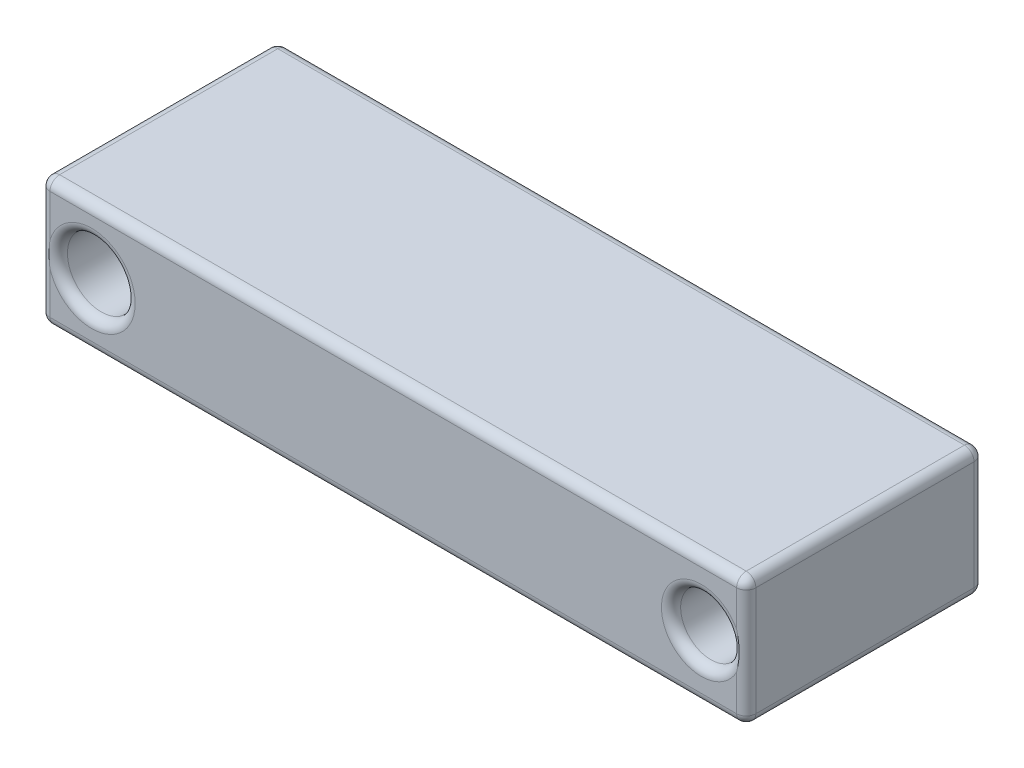
ISO-10303-21;
HEADER;
FILE_DESCRIPTION(('STEP AP214'),'2;1');
FILE_NAME('part.step','',(''),(''),'','','');
FILE_SCHEMA(('AUTOMOTIVE_DESIGN { 1 0 10303 214 1 1 1 1 }'));
ENDSEC;
DATA;
#1=APPLICATION_CONTEXT('core data for automotive mechanical design processes');
#2=APPLICATION_PROTOCOL_DEFINITION('international standard','automotive_design',2000,#1);
#3=PRODUCT_CONTEXT('',#1,'mechanical');
#4=PRODUCT('Part','Part','',(#3));
#5=PRODUCT_RELATED_PRODUCT_CATEGORY('part','',(#4));
#6=PRODUCT_DEFINITION_FORMATION('','',#4);
#7=PRODUCT_DEFINITION_CONTEXT('part definition',#1,'design');
#8=PRODUCT_DEFINITION('design','',#6,#7);
#9=PRODUCT_DEFINITION_SHAPE('','',#8);
#10=(LENGTH_UNIT() NAMED_UNIT(*) SI_UNIT(.MILLI.,.METRE.));
#11=(NAMED_UNIT(*) PLANE_ANGLE_UNIT() SI_UNIT($,.RADIAN.));
#12=(NAMED_UNIT(*) SI_UNIT($,.STERADIAN.) SOLID_ANGLE_UNIT());
#13=UNCERTAINTY_MEASURE_WITH_UNIT(LENGTH_MEASURE(1.E-05),#10,'distance_accuracy_value','');
#14=(GEOMETRIC_REPRESENTATION_CONTEXT(3) GLOBAL_UNCERTAINTY_ASSIGNED_CONTEXT((#13)) GLOBAL_UNIT_ASSIGNED_CONTEXT((#10,
#11,#12)) REPRESENTATION_CONTEXT('',''));
#15=CARTESIAN_POINT('',(0.,0.,0.));
#16=DIRECTION('',(0.,0.,1.));
#17=DIRECTION('',(1.,0.,0.));
#18=AXIS2_PLACEMENT_3D('',#15,#16,#17);
#19=CARTESIAN_POINT('',(-95.3818963448304,55.5062245954553,37.));
#20=DIRECTION('',(1.,0.,0.));
#21=DIRECTION('',(0.,1.,0.));
#22=AXIS2_PLACEMENT_3D('',#19,#20,#21);
#23=PLANE('',#22);
#24=DIRECTION('',(0.,-1.,0.));
#25=VECTOR('',#24,1.);
#26=CARTESIAN_POINT('',(-95.3818963448304,55.5062245954553,1.5));
#27=LINE('',#26,#25);
#28=CARTESIAN_POINT('',(-95.3818963448304,54.0062245954553,1.5));
#29=VERTEX_POINT('',#28);
#30=CARTESIAN_POINT('',(-95.3818963448304,37.0062245954553,1.5));
#31=VERTEX_POINT('',#30);
#32=EDGE_CURVE('E196',#29,#31,#27,.T.);
#33=ORIENTED_EDGE('',*,*,#32,.T.);
#34=DIRECTION('',(0.,0.,-1.));
#35=VECTOR('',#34,1.);
#36=CARTESIAN_POINT('',(-95.3818963448304,37.0062245954553,37.));
#37=LINE('',#36,#35);
#38=CARTESIAN_POINT('',(-95.3818963448304,37.0062245954553,35.5));
#39=VERTEX_POINT('',#38);
#40=EDGE_CURVE('E198',#31,#39,#37,.F.);
#41=ORIENTED_EDGE('',*,*,#40,.T.);
#42=DIRECTION('',(0.,-1.,0.));
#43=VECTOR('',#42,1.);
#44=CARTESIAN_POINT('',(-95.3818963448304,55.5062245954553,35.5));
#45=LINE('',#44,#43);
#46=CARTESIAN_POINT('',(-95.3818963448304,54.0062245954553,35.5));
#47=VERTEX_POINT('',#46);
#48=EDGE_CURVE('E192',#39,#47,#45,.F.);
#49=ORIENTED_EDGE('',*,*,#48,.T.);
#50=DIRECTION('',(0.,0.,-1.));
#51=VECTOR('',#50,1.);
#52=CARTESIAN_POINT('',(-95.3818963448304,54.0062245954553,37.));
#53=LINE('',#52,#51);
#54=EDGE_CURVE('E194',#47,#29,#53,.T.);
#55=ORIENTED_EDGE('',*,*,#54,.T.);
#56=EDGE_LOOP('',(#33,#41,#49,#55));
#57=FACE_BOUND('',#56,.T.);
#58=ADVANCED_FACE('F31',(#57),#23,.F.);
#59=CARTESIAN_POINT('',(-95.3818963448304,35.5062245954553,37.));
#60=DIRECTION('',(0.,1.,0.));
#61=DIRECTION('',(0.,0.,1.));
#62=AXIS2_PLACEMENT_3D('',#59,#60,#61);
#63=PLANE('',#62);
#64=DIRECTION('',(1.,0.,0.));
#65=VECTOR('',#64,1.);
#66=CARTESIAN_POINT('',(-95.3818963448304,35.5062245954553,35.5));
#67=LINE('',#66,#65);
#68=CARTESIAN_POINT('',(13.1181036551696,35.5062245954553,35.5));
#69=VERTEX_POINT('',#68);
#70=CARTESIAN_POINT('',(-93.8818963448304,35.5062245954553,35.5));
#71=VERTEX_POINT('',#70);
#72=EDGE_CURVE('E152',#69,#71,#67,.F.);
#73=ORIENTED_EDGE('',*,*,#72,.T.);
#74=DIRECTION('',(0.,0.,-1.));
#75=VECTOR('',#74,1.);
#76=CARTESIAN_POINT('',(-93.8818963448304,35.5062245954553,37.));
#77=LINE('',#76,#75);
#78=CARTESIAN_POINT('',(-93.8818963448304,35.5062245954553,1.5));
#79=VERTEX_POINT('',#78);
#80=EDGE_CURVE('E190',#71,#79,#77,.T.);
#81=ORIENTED_EDGE('',*,*,#80,.T.);
#82=DIRECTION('',(1.,0.,0.));
#83=VECTOR('',#82,1.);
#84=CARTESIAN_POINT('',(-95.3818963448304,35.5062245954553,1.5));
#85=LINE('',#84,#83);
#86=CARTESIAN_POINT('',(13.1181036551696,35.5062245954553,1.5));
#87=VERTEX_POINT('',#86);
#88=EDGE_CURVE('E155',#79,#87,#85,.T.);
#89=ORIENTED_EDGE('',*,*,#88,.T.);
#90=DIRECTION('',(0.,0.,-1.));
#91=VECTOR('',#90,1.);
#92=CARTESIAN_POINT('',(13.1181036551696,35.5062245954553,37.));
#93=LINE('',#92,#91);
#94=EDGE_CURVE('E147',#87,#69,#93,.F.);
#95=ORIENTED_EDGE('',*,*,#94,.T.);
#96=EDGE_LOOP('',(#73,#81,#89,#95));
#97=FACE_BOUND('',#96,.T.);
#98=ADVANCED_FACE('F149',(#97),#63,.F.);
#99=CARTESIAN_POINT('',(14.6181036551696,55.5062245954553,37.));
#100=DIRECTION('',(-1.,0.,0.));
#101=DIRECTION('',(0.,0.,1.));
#102=AXIS2_PLACEMENT_3D('',#99,#100,#101);
#103=PLANE('',#102);
#104=DIRECTION('',(0.,1.,0.));
#105=VECTOR('',#104,1.);
#106=CARTESIAN_POINT('',(14.6181036551696,35.5062245954553,35.5));
#107=LINE('',#106,#105);
#108=CARTESIAN_POINT('',(14.6181036551696,54.0062245954553,35.5));
#109=VERTEX_POINT('',#108);
#110=CARTESIAN_POINT('',(14.6181036551696,37.0062245954553,35.5));
#111=VERTEX_POINT('',#110);
#112=EDGE_CURVE('E232',#109,#111,#107,.F.);
#113=ORIENTED_EDGE('',*,*,#112,.T.);
#114=DIRECTION('',(0.,0.,-1.));
#115=VECTOR('',#114,1.);
#116=CARTESIAN_POINT('',(14.6181036551696,37.0062245954553,37.));
#117=LINE('',#116,#115);
#118=CARTESIAN_POINT('',(14.6181036551696,37.0062245954553,1.5));
#119=VERTEX_POINT('',#118);
#120=EDGE_CURVE('E166',#111,#119,#117,.T.);
#121=ORIENTED_EDGE('',*,*,#120,.T.);
#122=DIRECTION('',(0.,1.,0.));
#123=VECTOR('',#122,1.);
#124=CARTESIAN_POINT('',(14.6181036551696,55.5062245954553,1.5));
#125=LINE('',#124,#123);
#126=CARTESIAN_POINT('',(14.6181036551696,54.0062245954553,1.5));
#127=VERTEX_POINT('',#126);
#128=EDGE_CURVE('E236',#119,#127,#125,.T.);
#129=ORIENTED_EDGE('',*,*,#128,.T.);
#130=DIRECTION('',(0.,0.,-1.));
#131=VECTOR('',#130,1.);
#132=CARTESIAN_POINT('',(14.6181036551696,54.0062245954553,37.));
#133=LINE('',#132,#131);
#134=EDGE_CURVE('E234',#127,#109,#133,.F.);
#135=ORIENTED_EDGE('',*,*,#134,.T.);
#136=EDGE_LOOP('',(#113,#121,#129,#135));
#137=FACE_BOUND('',#136,.T.);
#138=ADVANCED_FACE('F428',(#137),#103,.F.);
#139=CARTESIAN_POINT('',(-95.3818963448304,55.5062245954553,37.));
#140=DIRECTION('',(0.,-1.,0.));
#141=DIRECTION('',(0.,0.,-1.));
#142=AXIS2_PLACEMENT_3D('',#139,#140,#141);
#143=PLANE('',#142);
#144=DIRECTION('',(0.,0.,-1.));
#145=VECTOR('',#144,1.);
#146=CARTESIAN_POINT('',(13.1181036551696,55.5062245954553,37.));
#147=LINE('',#146,#145);
#148=CARTESIAN_POINT('',(13.1181036551696,55.5062245954553,35.5));
#149=VERTEX_POINT('',#148);
#150=CARTESIAN_POINT('',(13.1181036551696,55.5062245954553,1.5));
#151=VERTEX_POINT('',#150);
#152=EDGE_CURVE('E243',#149,#151,#147,.T.);
#153=ORIENTED_EDGE('',*,*,#152,.T.);
#154=DIRECTION('',(-1.,0.,0.));
#155=VECTOR('',#154,1.);
#156=CARTESIAN_POINT('',(-95.3818963448304,55.5062245954553,1.5));
#157=LINE('',#156,#155);
#158=CARTESIAN_POINT('',(-93.8818963448304,55.5062245954553,1.5));
#159=VERTEX_POINT('',#158);
#160=EDGE_CURVE('E246',#151,#159,#157,.T.);
#161=ORIENTED_EDGE('',*,*,#160,.T.);
#162=DIRECTION('',(0.,0.,-1.));
#163=VECTOR('',#162,1.);
#164=CARTESIAN_POINT('',(-93.8818963448304,55.5062245954553,37.));
#165=LINE('',#164,#163);
#166=CARTESIAN_POINT('',(-93.8818963448304,55.5062245954553,35.5));
#167=VERTEX_POINT('',#166);
#168=EDGE_CURVE('E241',#159,#167,#165,.F.);
#169=ORIENTED_EDGE('',*,*,#168,.T.);
#170=DIRECTION('',(-1.,0.,0.));
#171=VECTOR('',#170,1.);
#172=CARTESIAN_POINT('',(14.6181036551696,55.5062245954553,35.5));
#173=LINE('',#172,#171);
#174=EDGE_CURVE('E239',#167,#149,#173,.F.);
#175=ORIENTED_EDGE('',*,*,#174,.T.);
#176=EDGE_LOOP('',(#153,#161,#169,#175));
#177=FACE_BOUND('',#176,.T.);
#178=ADVANCED_FACE('F656',(#177),#143,.F.);
#179=CARTESIAN_POINT('',(-95.3818963448304,35.5062245954553,37.));
#180=DIRECTION('',(0.,0.,1.));
#181=DIRECTION('',(1.,0.,0.));
#182=AXIS2_PLACEMENT_3D('',#179,#180,#181);
#183=PLANE('',#182);
#184=CARTESIAN_POINT('',(-87.3818963448304,45.5062245954553,37.));
#185=DIRECTION('',(0.,0.,1.));
#186=DIRECTION('',(1.,0.,0.));
#187=AXIS2_PLACEMENT_3D('',#184,#185,#186);
#188=CIRCLE('',#187,6.77503221367372);
#189=CARTESIAN_POINT('',(-93.8818963448304,47.4169996989975,37.));
#190=VERTEX_POINT('',#189);
#191=CARTESIAN_POINT('',(-80.6068641311566,45.5062245954553,37.));
#192=VERTEX_POINT('',#191);
#193=EDGE_CURVE('E51',#190,#192,#188,.F.);
#194=ORIENTED_EDGE('',*,*,#193,.T.);
#195=CARTESIAN_POINT('',(-87.3818963448304,45.5062245954553,37.));
#196=DIRECTION('',(0.,0.,1.));
#197=DIRECTION('',(1.,0.,0.));
#198=AXIS2_PLACEMENT_3D('',#195,#196,#197);
#199=CIRCLE('',#198,6.77503221367372);
#200=CARTESIAN_POINT('',(-93.8818963448304,43.5954494919131,37.));
#201=VERTEX_POINT('',#200);
#202=EDGE_CURVE('E11',#192,#201,#199,.F.);
#203=ORIENTED_EDGE('',*,*,#202,.T.);
#204=DIRECTION('',(0.,-1.,0.));
#205=VECTOR('',#204,1.);
#206=CARTESIAN_POINT('',(-93.8818963448304,35.5062245954553,37.));
#207=LINE('',#206,#205);
#208=CARTESIAN_POINT('',(-93.8818963448304,37.0062245954553,37.));
#209=VERTEX_POINT('',#208);
#210=EDGE_CURVE('E40',#201,#209,#207,.T.);
#211=ORIENTED_EDGE('',*,*,#210,.T.);
#212=DIRECTION('',(1.,0.,0.));
#213=VECTOR('',#212,1.);
#214=CARTESIAN_POINT('',(14.6181036551696,37.0062245954553,37.));
#215=LINE('',#214,#213);
#216=CARTESIAN_POINT('',(13.1181036551696,37.0062245954553,37.));
#217=VERTEX_POINT('',#216);
#218=EDGE_CURVE('E259',#209,#217,#215,.T.);
#219=ORIENTED_EDGE('',*,*,#218,.T.);
#220=DIRECTION('',(0.,1.,0.));
#221=VECTOR('',#220,1.);
#222=CARTESIAN_POINT('',(13.1181036551696,55.5062245954553,37.));
#223=LINE('',#222,#221);
#224=CARTESIAN_POINT('',(13.1181036551696,42.614107788662,37.));
#225=VERTEX_POINT('',#224);
#226=EDGE_CURVE('E252',#217,#225,#223,.T.);
#227=ORIENTED_EDGE('',*,*,#226,.T.);
#228=CARTESIAN_POINT('',(7.61810365516963,45.5062245954553,37.));
#229=DIRECTION('',(0.,0.,1.));
#230=DIRECTION('',(1.,0.,0.));
#231=AXIS2_PLACEMENT_3D('',#228,#229,#230);
#232=CIRCLE('',#231,6.21404374173019);
#233=CARTESIAN_POINT('',(13.1181036551696,48.3983414022486,37.));
#234=VERTEX_POINT('',#233);
#235=EDGE_CURVE('E248',#225,#234,#232,.F.);
#236=ORIENTED_EDGE('',*,*,#235,.T.);
#237=DIRECTION('',(0.,1.,0.));
#238=VECTOR('',#237,1.);
#239=CARTESIAN_POINT('',(13.1181036551696,55.5062245954553,37.));
#240=LINE('',#239,#238);
#241=CARTESIAN_POINT('',(13.1181036551696,54.0062245954553,37.));
#242=VERTEX_POINT('',#241);
#243=EDGE_CURVE('E250',#234,#242,#240,.T.);
#244=ORIENTED_EDGE('',*,*,#243,.T.);
#245=DIRECTION('',(-1.,0.,0.));
#246=VECTOR('',#245,1.);
#247=CARTESIAN_POINT('',(-95.3818963448304,54.0062245954553,37.));
#248=LINE('',#247,#246);
#249=CARTESIAN_POINT('',(-93.8818963448304,54.0062245954553,37.));
#250=VERTEX_POINT('',#249);
#251=EDGE_CURVE('E254',#242,#250,#248,.T.);
#252=ORIENTED_EDGE('',*,*,#251,.T.);
#253=DIRECTION('',(0.,-1.,0.));
#254=VECTOR('',#253,1.);
#255=CARTESIAN_POINT('',(-93.8818963448304,35.5062245954553,37.));
#256=LINE('',#255,#254);
#257=EDGE_CURVE('E257',#250,#190,#256,.T.);
#258=ORIENTED_EDGE('',*,*,#257,.T.);
#259=EDGE_LOOP('',(#194,#203,#211,#219,#227,#236,#244,#252,#258));
#260=FACE_BOUND('',#259,.T.);
#261=ADVANCED_FACE('F406',(#260),#183,.T.);
#262=CARTESIAN_POINT('',(-95.3818963448304,35.5062245954553,0.));
#263=DIRECTION('',(0.,0.,1.));
#264=DIRECTION('',(1.,0.,0.));
#265=AXIS2_PLACEMENT_3D('',#262,#263,#264);
#266=PLANE('',#265);
#267=DIRECTION('',(0.,1.,0.));
#268=VECTOR('',#267,1.);
#269=CARTESIAN_POINT('',(13.1181036551696,35.5062245954553,0.));
#270=LINE('',#269,#268);
#271=CARTESIAN_POINT('',(13.1181036551696,42.614107788662,0.));
#272=VERTEX_POINT('',#271);
#273=CARTESIAN_POINT('',(13.1181036551696,37.0062245954553,0.));
#274=VERTEX_POINT('',#273);
#275=EDGE_CURVE('E209',#272,#274,#270,.F.);
#276=ORIENTED_EDGE('',*,*,#275,.T.);
#277=DIRECTION('',(1.,0.,0.));
#278=VECTOR('',#277,1.);
#279=CARTESIAN_POINT('',(-95.3818963448304,37.0062245954553,0.));
#280=LINE('',#279,#278);
#281=CARTESIAN_POINT('',(-93.8818963448304,37.0062245954553,0.));
#282=VERTEX_POINT('',#281);
#283=EDGE_CURVE('E217',#274,#282,#280,.F.);
#284=ORIENTED_EDGE('',*,*,#283,.T.);
#285=DIRECTION('',(0.,-1.,0.));
#286=VECTOR('',#285,1.);
#287=CARTESIAN_POINT('',(-93.8818963448304,35.5062245954553,0.));
#288=LINE('',#287,#286);
#289=CARTESIAN_POINT('',(-93.8818963448304,43.5954494919131,0.));
#290=VERTEX_POINT('',#289);
#291=EDGE_CURVE('E215',#282,#290,#288,.F.);
#292=ORIENTED_EDGE('',*,*,#291,.T.);
#293=CARTESIAN_POINT('',(-87.3818963448304,45.5062245954553,0.));
#294=DIRECTION('',(0.,0.,1.));
#295=DIRECTION('',(1.,0.,0.));
#296=AXIS2_PLACEMENT_3D('',#293,#294,#295);
#297=CIRCLE('',#296,6.77503221367372);
#298=CARTESIAN_POINT('',(-80.6068641311566,45.5062245954553,0.));
#299=VERTEX_POINT('',#298);
#300=EDGE_CURVE('E213',#290,#299,#297,.T.);
#301=ORIENTED_EDGE('',*,*,#300,.T.);
#302=CARTESIAN_POINT('',(-87.3818963448304,45.5062245954553,0.));
#303=DIRECTION('',(0.,0.,1.));
#304=DIRECTION('',(1.,0.,0.));
#305=AXIS2_PLACEMENT_3D('',#302,#303,#304);
#306=CIRCLE('',#305,6.77503221367372);
#307=CARTESIAN_POINT('',(-93.8818963448304,47.4169996989975,0.));
#308=VERTEX_POINT('',#307);
#309=EDGE_CURVE('E211',#299,#308,#306,.T.);
#310=ORIENTED_EDGE('',*,*,#309,.T.);
#311=DIRECTION('',(0.,-1.,0.));
#312=VECTOR('',#311,1.);
#313=CARTESIAN_POINT('',(-93.8818963448304,35.5062245954553,0.));
#314=LINE('',#313,#312);
#315=CARTESIAN_POINT('',(-93.8818963448304,54.0062245954553,0.));
#316=VERTEX_POINT('',#315);
#317=EDGE_CURVE('E207',#308,#316,#314,.F.);
#318=ORIENTED_EDGE('',*,*,#317,.T.);
#319=DIRECTION('',(-1.,0.,0.));
#320=VECTOR('',#319,1.);
#321=CARTESIAN_POINT('',(-95.3818963448304,54.0062245954553,0.));
#322=LINE('',#321,#320);
#323=CARTESIAN_POINT('',(13.1181036551696,54.0062245954553,0.));
#324=VERTEX_POINT('',#323);
#325=EDGE_CURVE('E201',#316,#324,#322,.F.);
#326=ORIENTED_EDGE('',*,*,#325,.T.);
#327=DIRECTION('',(0.,1.,0.));
#328=VECTOR('',#327,1.);
#329=CARTESIAN_POINT('',(13.1181036551696,35.5062245954553,0.));
#330=LINE('',#329,#328);
#331=CARTESIAN_POINT('',(13.1181036551696,48.3983414022486,0.));
#332=VERTEX_POINT('',#331);
#333=EDGE_CURVE('E203',#324,#332,#330,.F.);
#334=ORIENTED_EDGE('',*,*,#333,.T.);
#335=CARTESIAN_POINT('',(7.61810365516963,45.5062245954553,0.));
#336=DIRECTION('',(0.,0.,1.));
#337=DIRECTION('',(1.,0.,0.));
#338=AXIS2_PLACEMENT_3D('',#335,#336,#337);
#339=CIRCLE('',#338,6.21404374173019);
#340=EDGE_CURVE('E205',#332,#272,#339,.T.);
#341=ORIENTED_EDGE('',*,*,#340,.T.);
#342=EDGE_LOOP('',(#276,#284,#292,#301,#310,#318,#326,#334,#341));
#343=FACE_BOUND('',#342,.T.);
#344=ADVANCED_FACE('F458',(#343),#266,.F.);
#345=CARTESIAN_POINT('',(-87.3818963448304,45.5062245954553,-73.));
#346=DIRECTION('',(0.,0.,1.));
#347=DIRECTION('',(1.,0.,0.));
#348=AXIS2_PLACEMENT_3D('',#345,#346,#347);
#349=CYLINDRICAL_SURFACE('',#348,5.27503221367373);
#350=CARTESIAN_POINT('',(-87.3818963448304,45.5062245954553,1.5));
#351=DIRECTION('',(0.,0.,1.));
#352=DIRECTION('',(1.,0.,0.));
#353=AXIS2_PLACEMENT_3D('',#350,#351,#352);
#354=CIRCLE('',#353,5.27503221367373);
#355=CARTESIAN_POINT('',(-82.1068641311566,45.5062245954553,1.5));
#356=VERTEX_POINT('',#355);
#357=EDGE_CURVE('E223',#356,#356,#354,.F.);
#358=ORIENTED_EDGE('',*,*,#357,.T.);
#359=EDGE_LOOP('',(#358));
#360=FACE_BOUND('',#359,.T.);
#361=CARTESIAN_POINT('',(-87.3818963448304,45.5062245954553,35.5));
#362=DIRECTION('',(0.,0.,1.));
#363=DIRECTION('',(1.,0.,0.));
#364=AXIS2_PLACEMENT_3D('',#361,#362,#363);
#365=CIRCLE('',#364,5.27503221367373);
#366=CARTESIAN_POINT('',(-82.1068641311566,45.5062245954553,35.5));
#367=VERTEX_POINT('',#366);
#368=EDGE_CURVE('E220',#367,#367,#365,.T.);
#369=ORIENTED_EDGE('',*,*,#368,.T.);
#370=EDGE_LOOP('',(#369));
#371=FACE_BOUND('',#370,.T.);
#372=ADVANCED_FACE('F418',(#360,#371),#349,.F.);
#373=CARTESIAN_POINT('',(7.61810365516963,45.5062245954553,-73.));
#374=DIRECTION('',(0.,0.,1.));
#375=DIRECTION('',(1.,0.,0.));
#376=AXIS2_PLACEMENT_3D('',#373,#374,#375);
#377=CYLINDRICAL_SURFACE('',#376,4.71404374173019);
#378=CARTESIAN_POINT('',(7.61810365516963,45.5062245954553,1.5));
#379=DIRECTION('',(0.,0.,1.));
#380=DIRECTION('',(1.,0.,0.));
#381=AXIS2_PLACEMENT_3D('',#378,#379,#380);
#382=CIRCLE('',#381,4.71404374173019);
#383=CARTESIAN_POINT('',(12.3321473968998,45.5062245954553,1.5));
#384=VERTEX_POINT('',#383);
#385=EDGE_CURVE('E229',#384,#384,#382,.F.);
#386=ORIENTED_EDGE('',*,*,#385,.T.);
#387=EDGE_LOOP('',(#386));
#388=FACE_BOUND('',#387,.T.);
#389=CARTESIAN_POINT('',(7.61810365516963,45.5062245954553,35.5));
#390=DIRECTION('',(0.,0.,1.));
#391=DIRECTION('',(1.,0.,0.));
#392=AXIS2_PLACEMENT_3D('',#389,#390,#391);
#393=CIRCLE('',#392,4.71404374173019);
#394=CARTESIAN_POINT('',(12.3321473968998,45.5062245954553,35.5));
#395=VERTEX_POINT('',#394);
#396=EDGE_CURVE('E226',#395,#395,#393,.T.);
#397=ORIENTED_EDGE('',*,*,#396,.T.);
#398=EDGE_LOOP('',(#397));
#399=FACE_BOUND('',#398,.T.);
#400=ADVANCED_FACE('F412',(#388,#399),#377,.F.);
#401=CARTESIAN_POINT('',(7.61810365516963,45.5062245954553,35.5));
#402=DIRECTION('',(0.,0.,1.));
#403=DIRECTION('',(1.,0.,0.));
#404=AXIS2_PLACEMENT_3D('',#401,#402,#403);
#405=TOROIDAL_SURFACE('',#404,6.21404374173019,1.5);
#406=ORIENTED_EDGE('',*,*,#396,.F.);
#407=EDGE_LOOP('',(#406));
#408=FACE_BOUND('',#407,.T.);
#409=CARTESIAN_POINT('',(13.1181036551696,48.3983414022486,37.0000000000002));
#410=CARTESIAN_POINT('',(13.1190108351164,48.3946670290878,36.9999999900651));
#411=CARTESIAN_POINT('',(13.1199163865421,48.3909922392755,36.9999991673936));
#412=CARTESIAN_POINT('',(13.1810919127136,48.1422620348768,36.9998890240707));
#413=CARTESIAN_POINT('',(13.2341170998976,47.8953620247745,36.9962024487693));
#414=CARTESIAN_POINT('',(13.3248821733547,47.3987412846634,36.9863812224742));
#415=CARTESIAN_POINT('',(13.362614814652,47.1490192751587,36.9802454138608));
#416=CARTESIAN_POINT('',(13.4222348443938,46.6473258664844,36.9691598803656));
#417=CARTESIAN_POINT('',(13.4441024756542,46.3953520568254,36.96421163951));
#418=CARTESIAN_POINT('',(13.4715401331192,45.8905252956117,36.9578369007387));
#419=CARTESIAN_POINT('',(13.4771141827083,45.637672576529,36.9564095334251));
#420=CARTESIAN_POINT('',(13.4720898805958,45.152372158647,36.9576318666698));
#421=CARTESIAN_POINT('',(13.4627490437685,44.9199095243563,36.9599646889044));
#422=CARTESIAN_POINT('',(13.4303392422213,44.4559490866011,36.9672366011665));
#423=CARTESIAN_POINT('',(13.4072679666656,44.224451452152,36.9721761298875));
#424=CARTESIAN_POINT('',(13.3477572684213,43.7635085113989,36.9826213207633));
#425=CARTESIAN_POINT('',(13.3113347166938,43.5340609877302,36.9881262621588));
#426=CARTESIAN_POINT('',(13.2255892185915,43.0776010204577,36.9967639394238));
#427=CARTESIAN_POINT('',(13.1762714080837,42.8505876447794,36.999897617779));
#428=CARTESIAN_POINT('',(13.1199163864516,42.6214569526408,36.9999991687853));
#429=CARTESIAN_POINT('',(13.1190108350176,42.6177821628249,36.999999991479));
#430=CARTESIAN_POINT('',(13.1181036551696,42.614107788662,37.));
#431=B_SPLINE_CURVE_WITH_KNOTS('',3,(#409,#410,#411,#412,#413,#414,#415,#416,#417,#418,#419,
#420,#421,#422,#423,#424,#425,#426,#427,#428,#429,#430),.UNSPECIFIED.,.F.,.F.,(4,2,2,2,2,2,2,2,
2,2,4),(0.,0.0113541575576603,0.768425729732102,1.52585555302292,2.28422701536521,
3.04241119673439,3.73997057803038,4.43764739193656,5.13444562839488,5.83096676871599,
5.84232092627595),.UNSPECIFIED.);
#432=EDGE_CURVE('E370',#234,#225,#431,.T.);
#433=ORIENTED_EDGE('',*,*,#432,.F.);
#434=ORIENTED_EDGE('',*,*,#235,.F.);
#435=EDGE_LOOP('',(#433,#434));
#436=FACE_BOUND('',#435,.T.);
#437=ADVANCED_FACE('F366',(#408,#436),#405,.T.);
#438=CARTESIAN_POINT('',(13.1181036551696,54.0062245954553,37.));
#439=DIRECTION('',(0.,0.,-1.));
#440=DIRECTION('',(-1.,0.,0.));
#441=AXIS2_PLACEMENT_3D('',#438,#439,#440);
#442=CYLINDRICAL_SURFACE('',#441,1.5);
#443=CARTESIAN_POINT('',(13.1181036551696,54.0062245954553,35.5));
#444=DIRECTION('',(0.,0.,1.));
#445=DIRECTION('',(1.,0.,0.));
#446=AXIS2_PLACEMENT_3D('',#443,#444,#445);
#447=CIRCLE('',#446,1.5);
#448=EDGE_CURVE('E35',#109,#149,#447,.T.);
#449=ORIENTED_EDGE('',*,*,#448,.F.);
#450=ORIENTED_EDGE('',*,*,#134,.F.);
#451=CARTESIAN_POINT('',(13.1181036551696,54.0062245954553,1.5));
#452=DIRECTION('',(0.,0.,-1.));
#453=DIRECTION('',(-1.,0.,0.));
#454=AXIS2_PLACEMENT_3D('',#451,#452,#453);
#455=CIRCLE('',#454,1.5);
#456=EDGE_CURVE('E187',#151,#127,#455,.T.);
#457=ORIENTED_EDGE('',*,*,#456,.F.);
#458=ORIENTED_EDGE('',*,*,#152,.F.);
#459=EDGE_LOOP('',(#449,#450,#457,#458));
#460=FACE_BOUND('',#459,.T.);
#461=ADVANCED_FACE('F33',(#460),#442,.T.);
#462=CARTESIAN_POINT('',(7.61810365516963,45.5062245954553,1.5));
#463=DIRECTION('',(0.,0.,1.));
#464=DIRECTION('',(1.,0.,0.));
#465=AXIS2_PLACEMENT_3D('',#462,#463,#464);
#466=TOROIDAL_SURFACE('',#465,6.21404374173019,1.5);
#467=ORIENTED_EDGE('',*,*,#385,.F.);
#468=EDGE_LOOP('',(#467));
#469=FACE_BOUND('',#468,.T.);
#470=CARTESIAN_POINT('',(13.1181036551696,48.3983414022486,-1.57139518962499E-13));
#471=CARTESIAN_POINT('',(13.119010835117,48.394667029088,9.93491198037219E-09));
#472=CARTESIAN_POINT('',(13.1199163865434,48.3909922392758,8.32606434442477E-07));
#473=CARTESIAN_POINT('',(13.1810919127535,48.1422620348958,0.000110975929102046));
#474=CARTESIAN_POINT('',(13.2341170999051,47.8953620247948,0.00379755123033658));
#475=CARTESIAN_POINT('',(13.3248821733379,47.3987412846942,0.0136187775251207));
#476=CARTESIAN_POINT('',(13.3626148146431,47.1490192751988,0.0197545861382695));
#477=CARTESIAN_POINT('',(13.4222348443919,46.647325866535,0.0308401196333145));
#478=CARTESIAN_POINT('',(13.444102475651,46.3953520568773,0.0357883604890741));
#479=CARTESIAN_POINT('',(13.4715401331165,45.8905252956689,0.0421630992607728));
#480=CARTESIAN_POINT('',(13.4771141827076,45.63767257659,0.0435904665746854));
#481=CARTESIAN_POINT('',(13.4720898805977,45.152372158705,0.0423681333306164));
#482=CARTESIAN_POINT('',(13.4627490437705,44.9199095244076,0.0400353110962249));
#483=CARTESIAN_POINT('',(13.4303392422254,44.4559490866364,0.0327633988341784));
#484=CARTESIAN_POINT('',(13.4072679666717,44.224451452178,0.0278238701130833));
#485=CARTESIAN_POINT('',(13.3477572684206,43.763508511414,0.0173786792370161));
#486=CARTESIAN_POINT('',(13.3113347166846,43.5340609877434,0.0118737378413987));
#487=CARTESIAN_POINT('',(13.2255892186035,43.0776010204594,0.00323606057626381));
#488=CARTESIAN_POINT('',(13.1762714081255,42.8505876447715,0.000102382221017771));
#489=CARTESIAN_POINT('',(13.1199163864529,42.6214569526405,8.31214670663331E-07));
#490=CARTESIAN_POINT('',(13.1190108350183,42.6177821628248,8.52102616538436E-09));
#491=CARTESIAN_POINT('',(13.1181036551696,42.614107788662,0.));
#492=B_SPLINE_CURVE_WITH_KNOTS('',3,(#470,#471,#472,#473,#474,#475,#476,#477,#478,#479,#480,
#481,#482,#483,#484,#485,#486,#487,#488,#489,#490,#491),.UNSPECIFIED.,.F.,.F.,(4,2,2,2,2,2,2,2,
2,2,4),(0.,0.0113541575576665,0.768425729705278,1.52585555297466,2.28422701531164,
3.04241119666969,3.73997057798627,4.43764739191826,5.13444562838819,5.83096676871607,
5.84232092627607),.UNSPECIFIED.);
#493=EDGE_CURVE('E341',#272,#332,#492,.F.);
#494=ORIENTED_EDGE('',*,*,#493,.F.);
#495=ORIENTED_EDGE('',*,*,#340,.F.);
#496=EDGE_LOOP('',(#494,#495));
#497=FACE_BOUND('',#496,.T.);
#498=ADVANCED_FACE('F351',(#469,#497),#466,.T.);
#499=CARTESIAN_POINT('',(13.1181036551696,54.0062245954553,35.5));
#500=DIRECTION('',(0.,0.,1.));
#501=DIRECTION('',(1.,0.,0.));
#502=AXIS2_PLACEMENT_3D('',#499,#500,#501);
#503=SPHERICAL_SURFACE('',#502,1.5);
#504=CARTESIAN_POINT('',(13.1181036551696,54.0062245954553,35.5));
#505=DIRECTION('',(0.,1.,0.));
#506=DIRECTION('',(0.,0.,1.));
#507=AXIS2_PLACEMENT_3D('',#504,#505,#506);
#508=CIRCLE('',#507,1.5);
#509=EDGE_CURVE('E377',#109,#242,#508,.F.);
#510=ORIENTED_EDGE('',*,*,#509,.F.);
#511=ORIENTED_EDGE('',*,*,#448,.T.);
#512=CARTESIAN_POINT('',(13.1181036551696,54.0062245954553,35.5));
#513=DIRECTION('',(1.,0.,0.));
#514=DIRECTION('',(0.,0.,-1.));
#515=AXIS2_PLACEMENT_3D('',#512,#513,#514);
#516=CIRCLE('',#515,1.5);
#517=EDGE_CURVE('E376',#242,#149,#516,.F.);
#518=ORIENTED_EDGE('',*,*,#517,.F.);
#519=EDGE_LOOP('',(#510,#511,#518));
#520=FACE_BOUND('',#519,.T.);
#521=ADVANCED_FACE('F400',(#520),#503,.T.);
#522=CARTESIAN_POINT('',(13.1181036551696,54.0062245954553,1.5));
#523=DIRECTION('',(0.,0.,1.));
#524=DIRECTION('',(1.,0.,0.));
#525=AXIS2_PLACEMENT_3D('',#522,#523,#524);
#526=SPHERICAL_SURFACE('',#525,1.5);
#527=CARTESIAN_POINT('',(13.1181036551696,54.0062245954553,1.5));
#528=DIRECTION('',(1.,0.,0.));
#529=DIRECTION('',(0.,1.,0.));
#530=AXIS2_PLACEMENT_3D('',#527,#528,#529);
#531=CIRCLE('',#530,1.5);
#532=EDGE_CURVE('E338',#151,#324,#531,.F.);
#533=ORIENTED_EDGE('',*,*,#532,.F.);
#534=ORIENTED_EDGE('',*,*,#456,.T.);
#535=CARTESIAN_POINT('',(13.1181036551696,54.0062245954553,1.5));
#536=DIRECTION('',(0.,1.,0.));
#537=DIRECTION('',(0.,0.,1.));
#538=AXIS2_PLACEMENT_3D('',#535,#536,#537);
#539=CIRCLE('',#538,1.5);
#540=EDGE_CURVE('E349',#324,#127,#539,.F.);
#541=ORIENTED_EDGE('',*,*,#540,.F.);
#542=EDGE_LOOP('',(#533,#534,#541));
#543=FACE_BOUND('',#542,.T.);
#544=ADVANCED_FACE('F385',(#543),#526,.T.);
#545=CARTESIAN_POINT('',(-95.3818963448304,54.0062245954553,35.5));
#546=DIRECTION('',(1.,0.,0.));
#547=DIRECTION('',(0.,0.,-1.));
#548=AXIS2_PLACEMENT_3D('',#545,#546,#547);
#549=CYLINDRICAL_SURFACE('',#548,1.5);
#550=ORIENTED_EDGE('',*,*,#517,.T.);
#551=ORIENTED_EDGE('',*,*,#174,.F.);
#552=CARTESIAN_POINT('',(-93.8818963448304,54.0062245954553,35.5));
#553=DIRECTION('',(-1.,0.,0.));
#554=DIRECTION('',(0.,0.,1.));
#555=AXIS2_PLACEMENT_3D('',#552,#553,#554);
#556=CIRCLE('',#555,1.5);
#557=EDGE_CURVE('E332',#250,#167,#556,.T.);
#558=ORIENTED_EDGE('',*,*,#557,.F.);
#559=ORIENTED_EDGE('',*,*,#251,.F.);
#560=EDGE_LOOP('',(#550,#551,#558,#559));
#561=FACE_BOUND('',#560,.T.);
#562=ADVANCED_FACE('F405',(#561),#549,.T.);
#563=CARTESIAN_POINT('',(13.1181036551696,35.5062245954553,35.5));
#564=DIRECTION('',(0.,-1.,0.));
#565=DIRECTION('',(0.,0.,-1.));
#566=AXIS2_PLACEMENT_3D('',#563,#564,#565);
#567=CYLINDRICAL_SURFACE('',#566,1.5);
#568=ORIENTED_EDGE('',*,*,#432,.T.);
#569=ORIENTED_EDGE('',*,*,#226,.F.);
#570=CARTESIAN_POINT('',(13.1181036551696,37.0062245954553,35.5));
#571=DIRECTION('',(0.,-1.,0.));
#572=DIRECTION('',(0.,0.,-1.));
#573=AXIS2_PLACEMENT_3D('',#570,#571,#572);
#574=CIRCLE('',#573,1.5);
#575=EDGE_CURVE('E170',#111,#217,#574,.T.);
#576=ORIENTED_EDGE('',*,*,#575,.F.);
#577=ORIENTED_EDGE('',*,*,#112,.F.);
#578=ORIENTED_EDGE('',*,*,#509,.T.);
#579=ORIENTED_EDGE('',*,*,#243,.F.);
#580=EDGE_LOOP('',(#568,#569,#576,#577,#578,#579));
#581=FACE_BOUND('',#580,.T.);
#582=ADVANCED_FACE('F363',(#581),#567,.T.);
#583=CARTESIAN_POINT('',(13.1181036551696,37.0062245954553,37.));
#584=DIRECTION('',(0.,0.,-1.));
#585=DIRECTION('',(-1.,0.,0.));
#586=AXIS2_PLACEMENT_3D('',#583,#584,#585);
#587=CYLINDRICAL_SURFACE('',#586,1.5);
#588=CARTESIAN_POINT('',(13.1181036551696,37.0062245954553,1.5));
#589=DIRECTION('',(0.,0.,-1.));
#590=DIRECTION('',(-1.,0.,0.));
#591=AXIS2_PLACEMENT_3D('',#588,#589,#590);
#592=CIRCLE('',#591,1.5);
#593=EDGE_CURVE('E171',#119,#87,#592,.T.);
#594=ORIENTED_EDGE('',*,*,#593,.F.);
#595=ORIENTED_EDGE('',*,*,#120,.F.);
#596=CARTESIAN_POINT('',(13.1181036551696,37.0062245954553,35.5));
#597=DIRECTION('',(0.,0.,1.));
#598=DIRECTION('',(1.,0.,0.));
#599=AXIS2_PLACEMENT_3D('',#596,#597,#598);
#600=CIRCLE('',#599,1.5);
#601=EDGE_CURVE('E162',#69,#111,#600,.T.);
#602=ORIENTED_EDGE('',*,*,#601,.F.);
#603=ORIENTED_EDGE('',*,*,#94,.F.);
#604=EDGE_LOOP('',(#594,#595,#602,#603));
#605=FACE_BOUND('',#604,.T.);
#606=ADVANCED_FACE('F164',(#605),#587,.T.);
#607=CARTESIAN_POINT('',(13.1181036551696,55.5062245954553,1.5));
#608=DIRECTION('',(0.,1.,0.));
#609=DIRECTION('',(0.,0.,1.));
#610=AXIS2_PLACEMENT_3D('',#607,#608,#609);
#611=CYLINDRICAL_SURFACE('',#610,1.5);
#612=ORIENTED_EDGE('',*,*,#540,.T.);
#613=ORIENTED_EDGE('',*,*,#128,.F.);
#614=CARTESIAN_POINT('',(13.1181036551696,37.0062245954553,1.5));
#615=DIRECTION('',(0.,-1.,0.));
#616=DIRECTION('',(0.,0.,-1.));
#617=AXIS2_PLACEMENT_3D('',#614,#615,#616);
#618=CIRCLE('',#617,1.5);
#619=EDGE_CURVE('E328',#274,#119,#618,.T.);
#620=ORIENTED_EDGE('',*,*,#619,.F.);
#621=ORIENTED_EDGE('',*,*,#275,.F.);
#622=ORIENTED_EDGE('',*,*,#493,.T.);
#623=ORIENTED_EDGE('',*,*,#333,.F.);
#624=EDGE_LOOP('',(#612,#613,#620,#621,#622,#623));
#625=FACE_BOUND('',#624,.T.);
#626=ADVANCED_FACE('F356',(#625),#611,.T.);
#627=CARTESIAN_POINT('',(-95.3818963448304,54.0062245954553,1.5));
#628=DIRECTION('',(-1.,0.,0.));
#629=DIRECTION('',(0.,0.,1.));
#630=AXIS2_PLACEMENT_3D('',#627,#628,#629);
#631=CYLINDRICAL_SURFACE('',#630,1.5);
#632=ORIENTED_EDGE('',*,*,#532,.T.);
#633=ORIENTED_EDGE('',*,*,#325,.F.);
#634=CARTESIAN_POINT('',(-93.8818963448304,54.0062245954553,1.5));
#635=DIRECTION('',(-1.,0.,0.));
#636=DIRECTION('',(0.,0.,1.));
#637=AXIS2_PLACEMENT_3D('',#634,#635,#636);
#638=CIRCLE('',#637,1.5);
#639=EDGE_CURVE('E325',#159,#316,#638,.T.);
#640=ORIENTED_EDGE('',*,*,#639,.F.);
#641=ORIENTED_EDGE('',*,*,#160,.F.);
#642=EDGE_LOOP('',(#632,#633,#640,#641));
#643=FACE_BOUND('',#642,.T.);
#644=ADVANCED_FACE('F359',(#643),#631,.T.);
#645=CARTESIAN_POINT('',(-93.8818963448304,54.0062245954553,37.));
#646=DIRECTION('',(0.,0.,-1.));
#647=DIRECTION('',(-1.,0.,0.));
#648=AXIS2_PLACEMENT_3D('',#645,#646,#647);
#649=CYLINDRICAL_SURFACE('',#648,1.5);
#650=CARTESIAN_POINT('',(-93.8818963448304,54.0062245954553,35.5));
#651=DIRECTION('',(0.,0.,1.));
#652=DIRECTION('',(1.,0.,0.));
#653=AXIS2_PLACEMENT_3D('',#650,#651,#652);
#654=CIRCLE('',#653,1.5);
#655=EDGE_CURVE('E335',#167,#47,#654,.T.);
#656=ORIENTED_EDGE('',*,*,#655,.F.);
#657=ORIENTED_EDGE('',*,*,#168,.F.);
#658=CARTESIAN_POINT('',(-93.8818963448304,54.0062245954553,1.5));
#659=DIRECTION('',(0.,0.,-1.));
#660=DIRECTION('',(-1.,0.,0.));
#661=AXIS2_PLACEMENT_3D('',#658,#659,#660);
#662=CIRCLE('',#661,1.5);
#663=EDGE_CURVE('E322',#29,#159,#662,.T.);
#664=ORIENTED_EDGE('',*,*,#663,.F.);
#665=ORIENTED_EDGE('',*,*,#54,.F.);
#666=EDGE_LOOP('',(#656,#657,#664,#665));
#667=FACE_BOUND('',#666,.T.);
#668=ADVANCED_FACE('F493',(#667),#649,.T.);
#669=CARTESIAN_POINT('',(-93.8818963448304,54.0062245954553,35.5));
#670=DIRECTION('',(0.,0.,1.));
#671=DIRECTION('',(1.,0.,0.));
#672=AXIS2_PLACEMENT_3D('',#669,#670,#671);
#673=SPHERICAL_SURFACE('',#672,1.5);
#674=ORIENTED_EDGE('',*,*,#557,.T.);
#675=ORIENTED_EDGE('',*,*,#655,.T.);
#676=CARTESIAN_POINT('',(-93.8818963448304,54.0062245954553,35.5));
#677=DIRECTION('',(0.,1.,0.));
#678=DIRECTION('',(0.,0.,1.));
#679=AXIS2_PLACEMENT_3D('',#676,#677,#678);
#680=CIRCLE('',#679,1.5);
#681=EDGE_CURVE('E319',#250,#47,#680,.F.);
#682=ORIENTED_EDGE('',*,*,#681,.F.);
#683=EDGE_LOOP('',(#674,#675,#682));
#684=FACE_BOUND('',#683,.T.);
#685=ADVANCED_FACE('F500',(#684),#673,.T.);
#686=CARTESIAN_POINT('',(-87.3818963448304,45.5062245954553,35.5));
#687=DIRECTION('',(0.,0.,1.));
#688=DIRECTION('',(1.,0.,0.));
#689=AXIS2_PLACEMENT_3D('',#686,#687,#688);
#690=TOROIDAL_SURFACE('',#689,6.77503221367372,1.5);
#691=ORIENTED_EDGE('',*,*,#368,.F.);
#692=EDGE_LOOP('',(#691));
#693=FACE_BOUND('',#692,.T.);
#694=ORIENTED_EDGE('',*,*,#202,.F.);
#695=ORIENTED_EDGE('',*,*,#193,.F.);
#696=CARTESIAN_POINT('',(-93.8818963448304,43.5954494919131,37.));
#697=CARTESIAN_POINT('',(-93.8825890152434,43.6002617684606,36.9999999830193));
#698=CARTESIAN_POINT('',(-93.8832791216589,43.6050744350726,36.9999995038742));
#699=CARTESIAN_POINT('',(-93.9196049412176,43.8593692304429,36.9999502297938));
#700=CARTESIAN_POINT('',(-93.9483506108585,44.1098904891969,36.9986835069814));
#701=CARTESIAN_POINT('',(-93.9916863028605,44.6122191608059,36.9961350149443));
#702=CARTESIAN_POINT('',(-94.0062712837151,44.8640269996609,36.9948532405251));
#703=CARTESIAN_POINT('',(-94.0210883080003,45.3681597164376,36.993546412822));
#704=CARTESIAN_POINT('',(-94.0213154926664,45.6204847404911,36.9935217849646));
#705=CARTESIAN_POINT('',(-94.0073991400063,46.1246698211005,36.9947580500105));
#706=CARTESIAN_POINT('',(-93.9932599275836,46.3765299947362,36.9960185560337));
#707=CARTESIAN_POINT('',(-93.9610918390257,46.7573114341893,36.9979443564525));
#708=CARTESIAN_POINT('',(-93.9482636720498,46.8866946725485,36.9986022417175));
#709=CARTESIAN_POINT('',(-93.9188890049223,47.1449957437641,36.9996166820551));
#710=CARTESIAN_POINT('',(-93.9023439806463,47.2739137407682,36.9999733564647));
#711=CARTESIAN_POINT('',(-93.8832791209178,47.4073747469543,36.9999995146097));
#712=CARTESIAN_POINT('',(-93.8825890144606,47.4121874136118,36.9999999940158));
#713=CARTESIAN_POINT('',(-93.8818963448304,47.4169996989975,37.));
#714=B_SPLINE_CURVE_WITH_KNOTS('',3,(#696,#697,#698,#699,#700,#701,#702,#703,#704,#705,#706,
#707,#708,#709,#710,#711,#712,#713),.UNSPECIFIED.,.F.,.F.,(4,2,2,2,2,2,2,2,4),(0.,
0.0145856767413905,0.770625482416539,1.52693435575088,2.28349916718425,3.03983628752327,
3.4298517122259,3.81971254395242,3.83429822069381),.UNSPECIFIED.);
#715=EDGE_CURVE('E178',#201,#190,#714,.T.);
#716=ORIENTED_EDGE('',*,*,#715,.F.);
#717=EDGE_LOOP('',(#694,#695,#716));
#718=FACE_BOUND('',#717,.T.);
#719=ADVANCED_FACE('F310',(#693,#718),#690,.T.);
#720=CARTESIAN_POINT('',(13.1181036551696,37.0062245954553,35.5));
#721=DIRECTION('',(0.,0.,1.));
#722=DIRECTION('',(1.,0.,0.));
#723=AXIS2_PLACEMENT_3D('',#720,#721,#722);
#724=SPHERICAL_SURFACE('',#723,1.5);
#725=ORIENTED_EDGE('',*,*,#601,.T.);
#726=ORIENTED_EDGE('',*,*,#575,.T.);
#727=CARTESIAN_POINT('',(13.1181036551696,37.0062245954553,35.5));
#728=DIRECTION('',(1.,0.,0.));
#729=DIRECTION('',(0.,1.,0.));
#730=AXIS2_PLACEMENT_3D('',#727,#728,#729);
#731=CIRCLE('',#730,1.5);
#732=EDGE_CURVE('E174',#69,#217,#731,.F.);
#733=ORIENTED_EDGE('',*,*,#732,.F.);
#734=EDGE_LOOP('',(#725,#726,#733));
#735=FACE_BOUND('',#734,.T.);
#736=ADVANCED_FACE('F175',(#735),#724,.T.);
#737=CARTESIAN_POINT('',(13.1181036551696,37.0062245954553,1.5));
#738=DIRECTION('',(0.,0.,1.));
#739=DIRECTION('',(1.,0.,0.));
#740=AXIS2_PLACEMENT_3D('',#737,#738,#739);
#741=SPHERICAL_SURFACE('',#740,1.5);
#742=ORIENTED_EDGE('',*,*,#619,.T.);
#743=ORIENTED_EDGE('',*,*,#593,.T.);
#744=CARTESIAN_POINT('',(13.1181036551696,37.0062245954553,1.5));
#745=DIRECTION('',(1.,0.,0.));
#746=DIRECTION('',(0.,0.,-1.));
#747=AXIS2_PLACEMENT_3D('',#744,#745,#746);
#748=CIRCLE('',#747,1.5);
#749=EDGE_CURVE('E179',#274,#87,#748,.F.);
#750=ORIENTED_EDGE('',*,*,#749,.F.);
#751=EDGE_LOOP('',(#742,#743,#750));
#752=FACE_BOUND('',#751,.T.);
#753=ADVANCED_FACE('F294',(#752),#741,.T.);
#754=CARTESIAN_POINT('',(-87.3818963448304,45.5062245954553,1.5));
#755=DIRECTION('',(0.,0.,1.));
#756=DIRECTION('',(1.,0.,0.));
#757=AXIS2_PLACEMENT_3D('',#754,#755,#756);
#758=TOROIDAL_SURFACE('',#757,6.77503221367372,1.5);
#759=ORIENTED_EDGE('',*,*,#357,.F.);
#760=EDGE_LOOP('',(#759));
#761=FACE_BOUND('',#760,.T.);
#762=ORIENTED_EDGE('',*,*,#309,.F.);
#763=ORIENTED_EDGE('',*,*,#300,.F.);
#764=CARTESIAN_POINT('',(-93.8818963448304,47.4169996989975,0.));
#765=CARTESIAN_POINT('',(-93.8825890152443,47.4121874224501,1.69806656531197E-08));
#766=CARTESIAN_POINT('',(-93.8832791216607,47.4073747558382,4.96125805868735E-07));
#767=CARTESIAN_POINT('',(-93.9196049412621,47.1530799604823,4.97702059964903E-05));
#768=CARTESIAN_POINT('',(-93.9483506108689,46.9025587017318,0.00131649301849291));
#769=CARTESIAN_POINT('',(-93.9916863028462,46.400230030134,0.00386498505565465));
#770=CARTESIAN_POINT('',(-94.0062712837102,46.1484221912867,0.00514675947475972));
#771=CARTESIAN_POINT('',(-94.0210883080027,45.6442894745197,0.00645358717791956));
#772=CARTESIAN_POINT('',(-94.0213154926665,45.3919644504682,0.00647821503545784));
#773=CARTESIAN_POINT('',(-94.0073991400091,44.8877793698642,0.00524194998968466));
#774=CARTESIAN_POINT('',(-93.9932599275916,44.6359191962318,0.00398144396657496));
#775=CARTESIAN_POINT('',(-93.9610918390285,44.2551377567725,0.00205564354780332));
#776=CARTESIAN_POINT('',(-93.9482636720477,44.1257545184031,0.00139775828270303));
#777=CARTESIAN_POINT('',(-93.9188890049313,43.8674534471652,0.000383317944929457));
#778=CARTESIAN_POINT('',(-93.9023439806714,43.7385354501488,2.66435353896139E-05));
#779=CARTESIAN_POINT('',(-93.8832791209196,43.605074443956,4.85390309714923E-07));
#780=CARTESIAN_POINT('',(-93.8825890144615,43.6002617772986,5.98416168815291E-09));
#781=CARTESIAN_POINT('',(-93.8818963448304,43.5954494919131,0.));
#782=B_SPLINE_CURVE_WITH_KNOTS('',3,(#764,#765,#766,#767,#768,#769,#770,#771,#772,#773,#774,
#775,#776,#777,#778,#779,#780,#781),.UNSPECIFIED.,.F.,.F.,(4,2,2,2,2,2,2,2,4),(0.,
0.014585676741386,0.770625482391998,1.52693435570698,2.28349916713363,3.03983628746154,
3.42985171219631,3.81971254395258,3.83429822069396),.UNSPECIFIED.);
#783=EDGE_CURVE('E279',#308,#290,#782,.T.);
#784=ORIENTED_EDGE('',*,*,#783,.F.);
#785=EDGE_LOOP('',(#762,#763,#784));
#786=FACE_BOUND('',#785,.T.);
#787=ADVANCED_FACE('F289',(#761,#786),#758,.T.);
#788=CARTESIAN_POINT('',(-93.8818963448304,54.0062245954553,1.5));
#789=DIRECTION('',(0.,0.,1.));
#790=DIRECTION('',(1.,0.,0.));
#791=AXIS2_PLACEMENT_3D('',#788,#789,#790);
#792=SPHERICAL_SURFACE('',#791,1.5);
#793=ORIENTED_EDGE('',*,*,#663,.T.);
#794=ORIENTED_EDGE('',*,*,#639,.T.);
#795=CARTESIAN_POINT('',(-93.8818963448304,54.0062245954553,1.5));
#796=DIRECTION('',(0.,1.,0.));
#797=DIRECTION('',(0.,0.,1.));
#798=AXIS2_PLACEMENT_3D('',#795,#796,#797);
#799=CIRCLE('',#798,1.5);
#800=EDGE_CURVE('E276',#29,#316,#799,.F.);
#801=ORIENTED_EDGE('',*,*,#800,.F.);
#802=EDGE_LOOP('',(#793,#794,#801));
#803=FACE_BOUND('',#802,.T.);
#804=ADVANCED_FACE('F293',(#803),#792,.T.);
#805=CARTESIAN_POINT('',(-93.8818963448304,35.5062245954553,35.5));
#806=DIRECTION('',(0.,1.,0.));
#807=DIRECTION('',(-1.,0.,0.));
#808=AXIS2_PLACEMENT_3D('',#805,#806,#807);
#809=CYLINDRICAL_SURFACE('',#808,1.5);
#810=ORIENTED_EDGE('',*,*,#681,.T.);
#811=ORIENTED_EDGE('',*,*,#48,.F.);
#812=CARTESIAN_POINT('',(-93.8818963448304,37.0062245954553,35.5));
#813=DIRECTION('',(0.,-1.,0.));
#814=DIRECTION('',(0.,0.,-1.));
#815=AXIS2_PLACEMENT_3D('',#812,#813,#814);
#816=CIRCLE('',#815,1.5);
#817=EDGE_CURVE('E273',#209,#39,#816,.T.);
#818=ORIENTED_EDGE('',*,*,#817,.F.);
#819=ORIENTED_EDGE('',*,*,#210,.F.);
#820=ORIENTED_EDGE('',*,*,#715,.T.);
#821=ORIENTED_EDGE('',*,*,#257,.F.);
#822=EDGE_LOOP('',(#810,#811,#818,#819,#820,#821));
#823=FACE_BOUND('',#822,.T.);
#824=ADVANCED_FACE('F307',(#823),#809,.T.);
#825=CARTESIAN_POINT('',(-95.3818963448304,37.0062245954553,35.5));
#826=DIRECTION('',(-1.,0.,0.));
#827=DIRECTION('',(0.,0.,1.));
#828=AXIS2_PLACEMENT_3D('',#825,#826,#827);
#829=CYLINDRICAL_SURFACE('',#828,1.5);
#830=ORIENTED_EDGE('',*,*,#732,.T.);
#831=ORIENTED_EDGE('',*,*,#218,.F.);
#832=CARTESIAN_POINT('',(-93.8818963448304,37.0062245954553,35.5));
#833=DIRECTION('',(-1.,0.,0.));
#834=DIRECTION('',(0.,0.,1.));
#835=AXIS2_PLACEMENT_3D('',#832,#833,#834);
#836=CIRCLE('',#835,1.5);
#837=EDGE_CURVE('E183',#71,#209,#836,.T.);
#838=ORIENTED_EDGE('',*,*,#837,.F.);
#839=ORIENTED_EDGE('',*,*,#72,.F.);
#840=EDGE_LOOP('',(#830,#831,#838,#839));
#841=FACE_BOUND('',#840,.T.);
#842=ADVANCED_FACE('F181',(#841),#829,.T.);
#843=CARTESIAN_POINT('',(-95.3818963448304,37.0062245954553,1.5));
#844=DIRECTION('',(1.,0.,0.));
#845=DIRECTION('',(0.,0.,-1.));
#846=AXIS2_PLACEMENT_3D('',#843,#844,#845);
#847=CYLINDRICAL_SURFACE('',#846,1.5);
#848=ORIENTED_EDGE('',*,*,#749,.T.);
#849=ORIENTED_EDGE('',*,*,#88,.F.);
#850=CARTESIAN_POINT('',(-93.8818963448304,37.0062245954553,1.5));
#851=DIRECTION('',(-1.,0.,0.));
#852=DIRECTION('',(0.,0.,1.));
#853=AXIS2_PLACEMENT_3D('',#850,#851,#852);
#854=CIRCLE('',#853,1.5);
#855=EDGE_CURVE('E269',#282,#79,#854,.T.);
#856=ORIENTED_EDGE('',*,*,#855,.F.);
#857=ORIENTED_EDGE('',*,*,#283,.F.);
#858=EDGE_LOOP('',(#848,#849,#856,#857));
#859=FACE_BOUND('',#858,.T.);
#860=ADVANCED_FACE('F300',(#859),#847,.T.);
#861=CARTESIAN_POINT('',(-93.8818963448304,55.5062245954553,1.5));
#862=DIRECTION('',(0.,-1.,0.));
#863=DIRECTION('',(1.,0.,0.));
#864=AXIS2_PLACEMENT_3D('',#861,#862,#863);
#865=CYLINDRICAL_SURFACE('',#864,1.5);
#866=ORIENTED_EDGE('',*,*,#783,.T.);
#867=ORIENTED_EDGE('',*,*,#291,.F.);
#868=CARTESIAN_POINT('',(-93.8818963448304,37.0062245954553,1.5));
#869=DIRECTION('',(0.,-1.,0.));
#870=DIRECTION('',(0.,0.,-1.));
#871=AXIS2_PLACEMENT_3D('',#868,#869,#870);
#872=CIRCLE('',#871,1.5);
#873=EDGE_CURVE('E267',#31,#282,#872,.T.);
#874=ORIENTED_EDGE('',*,*,#873,.F.);
#875=ORIENTED_EDGE('',*,*,#32,.F.);
#876=ORIENTED_EDGE('',*,*,#800,.T.);
#877=ORIENTED_EDGE('',*,*,#317,.F.);
#878=EDGE_LOOP('',(#866,#867,#874,#875,#876,#877));
#879=FACE_BOUND('',#878,.T.);
#880=ADVANCED_FACE('F296',(#879),#865,.T.);
#881=CARTESIAN_POINT('',(-93.8818963448304,37.0062245954553,35.5));
#882=DIRECTION('',(0.,0.,1.));
#883=DIRECTION('',(1.,0.,0.));
#884=AXIS2_PLACEMENT_3D('',#881,#882,#883);
#885=SPHERICAL_SURFACE('',#884,1.5);
#886=ORIENTED_EDGE('',*,*,#837,.T.);
#887=ORIENTED_EDGE('',*,*,#817,.T.);
#888=CARTESIAN_POINT('',(-93.8818963448304,37.0062245954553,35.5));
#889=DIRECTION('',(0.,0.,1.));
#890=DIRECTION('',(1.,0.,0.));
#891=AXIS2_PLACEMENT_3D('',#888,#889,#890);
#892=CIRCLE('',#891,1.5);
#893=EDGE_CURVE('E265',#71,#39,#892,.F.);
#894=ORIENTED_EDGE('',*,*,#893,.F.);
#895=EDGE_LOOP('',(#886,#887,#894));
#896=FACE_BOUND('',#895,.T.);
#897=ADVANCED_FACE('F299',(#896),#885,.T.);
#898=CARTESIAN_POINT('',(-93.8818963448304,37.0062245954553,1.5));
#899=DIRECTION('',(0.,0.,1.));
#900=DIRECTION('',(1.,0.,0.));
#901=AXIS2_PLACEMENT_3D('',#898,#899,#900);
#902=SPHERICAL_SURFACE('',#901,1.5);
#903=ORIENTED_EDGE('',*,*,#873,.T.);
#904=ORIENTED_EDGE('',*,*,#855,.T.);
#905=CARTESIAN_POINT('',(-93.8818963448304,37.0062245954553,1.5));
#906=DIRECTION('',(0.,0.,-1.));
#907=DIRECTION('',(-1.,0.,0.));
#908=AXIS2_PLACEMENT_3D('',#905,#906,#907);
#909=CIRCLE('',#908,1.5);
#910=EDGE_CURVE('E263',#31,#79,#909,.F.);
#911=ORIENTED_EDGE('',*,*,#910,.F.);
#912=EDGE_LOOP('',(#903,#904,#911));
#913=FACE_BOUND('',#912,.T.);
#914=ADVANCED_FACE('F435',(#913),#902,.T.);
#915=CARTESIAN_POINT('',(-93.8818963448304,37.0062245954553,37.));
#916=DIRECTION('',(0.,0.,-1.));
#917=DIRECTION('',(-1.,0.,0.));
#918=AXIS2_PLACEMENT_3D('',#915,#916,#917);
#919=CYLINDRICAL_SURFACE('',#918,1.5);
#920=ORIENTED_EDGE('',*,*,#893,.T.);
#921=ORIENTED_EDGE('',*,*,#40,.F.);
#922=ORIENTED_EDGE('',*,*,#910,.T.);
#923=ORIENTED_EDGE('',*,*,#80,.F.);
#924=EDGE_LOOP('',(#920,#921,#922,#923));
#925=FACE_BOUND('',#924,.T.);
#926=ADVANCED_FACE('F432',(#925),#919,.T.);
#927=CLOSED_SHELL('',(#58,#98,#138,#178,#261,#344,#372,#400,#437,#461,#498,#521,#544,#562,#582,
#606,#626,#644,#668,#685,#719,#736,#753,#787,#804,#824,#842,#860,#880,#897,#914,#926));
#928=MANIFOLD_SOLID_BREP('B2',#927);
#929=ADVANCED_BREP_SHAPE_REPRESENTATION('',(#18,#928),#14);
#930=SHAPE_DEFINITION_REPRESENTATION(#9,#929);
ENDSEC;
END-ISO-10303-21;
